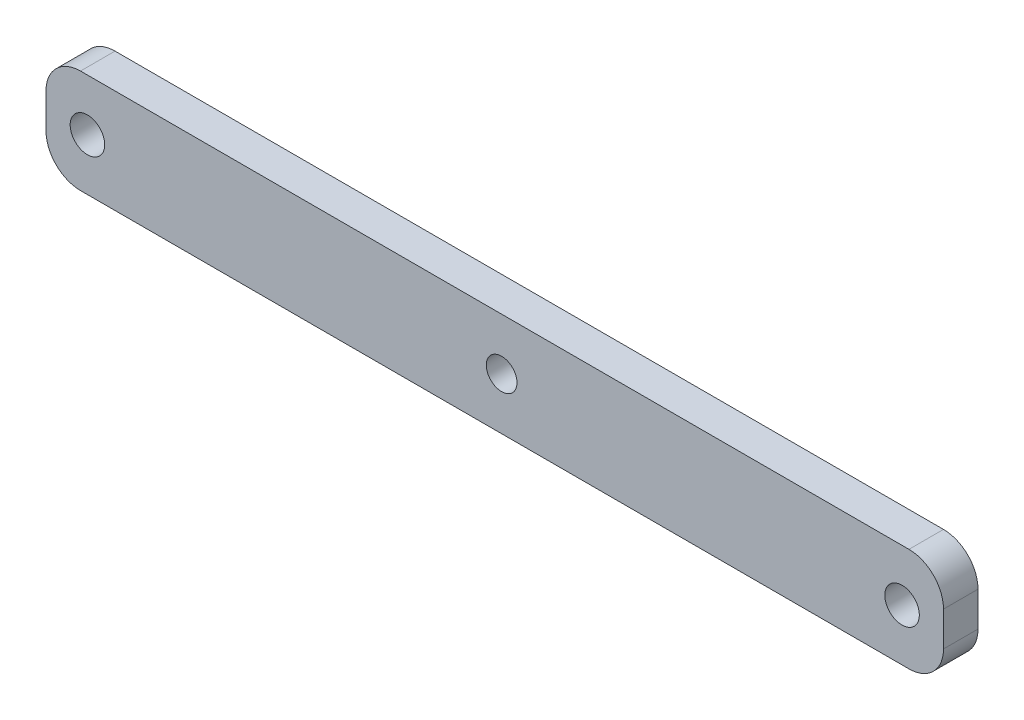
ISO-10303-21;
HEADER;
FILE_DESCRIPTION(('STEP AP214'),'2;1');
FILE_NAME('part.step','',(''),(''),'','','');
FILE_SCHEMA(('AUTOMOTIVE_DESIGN { 1 0 10303 214 1 1 1 1 }'));
ENDSEC;
DATA;
#1=APPLICATION_CONTEXT('core data for automotive mechanical design processes');
#2=APPLICATION_PROTOCOL_DEFINITION('international standard','automotive_design',2000,#1);
#3=PRODUCT_CONTEXT('',#1,'mechanical');
#4=PRODUCT('Part','Part','',(#3));
#5=PRODUCT_RELATED_PRODUCT_CATEGORY('part','',(#4));
#6=PRODUCT_DEFINITION_FORMATION('','',#4);
#7=PRODUCT_DEFINITION_CONTEXT('part definition',#1,'design');
#8=PRODUCT_DEFINITION('design','',#6,#7);
#9=PRODUCT_DEFINITION_SHAPE('','',#8);
#10=(LENGTH_UNIT() NAMED_UNIT(*) SI_UNIT(.MILLI.,.METRE.));
#11=(NAMED_UNIT(*) PLANE_ANGLE_UNIT() SI_UNIT($,.RADIAN.));
#12=(NAMED_UNIT(*) SI_UNIT($,.STERADIAN.) SOLID_ANGLE_UNIT());
#13=UNCERTAINTY_MEASURE_WITH_UNIT(LENGTH_MEASURE(1.E-05),#10,'distance_accuracy_value','');
#14=(GEOMETRIC_REPRESENTATION_CONTEXT(3) GLOBAL_UNCERTAINTY_ASSIGNED_CONTEXT((#13)) GLOBAL_UNIT_ASSIGNED_CONTEXT((#10,
#11,#12)) REPRESENTATION_CONTEXT('',''));
#15=CARTESIAN_POINT('',(0.,0.,0.));
#16=DIRECTION('',(0.,0.,1.));
#17=DIRECTION('',(1.,0.,0.));
#18=AXIS2_PLACEMENT_3D('',#15,#16,#17);
#19=CARTESIAN_POINT('',(-21.9862403540122,-6.9997524337533,5.));
#20=DIRECTION('',(0.,0.,-1.));
#21=DIRECTION('',(-1.,0.,0.));
#22=AXIS2_PLACEMENT_3D('',#19,#20,#21);
#23=PLANE('',#22);
#24=CARTESIAN_POINT('',(-21.9862403540122,-6.9997524337533,5.));
#25=DIRECTION('',(0.,0.,1.));
#26=DIRECTION('',(-1.,0.,0.));
#27=AXIS2_PLACEMENT_3D('',#24,#25,#26);
#28=CIRCLE('',#27,5.00000000000001);
#29=CARTESIAN_POINT('',(-21.9862403540122,-1.9997524337533,5.));
#30=VERTEX_POINT('',#29);
#31=CARTESIAN_POINT('',(-26.9862403540122,-6.9997524337533,5.));
#32=VERTEX_POINT('',#31);
#33=EDGE_CURVE('E147',#30,#32,#28,.T.);
#34=ORIENTED_EDGE('',*,*,#33,.T.);
#35=DIRECTION('',(0.,-1.,0.));
#36=VECTOR('',#35,1.);
#37=CARTESIAN_POINT('',(-26.9862403540122,-11.9997524337533,5.));
#38=LINE('',#37,#36);
#39=CARTESIAN_POINT('',(-26.9862403540122,-11.9997524337533,5.));
#40=VERTEX_POINT('',#39);
#41=EDGE_CURVE('E95',#32,#40,#38,.T.);
#42=ORIENTED_EDGE('',*,*,#41,.T.);
#43=CARTESIAN_POINT('',(-21.9862403540122,-11.9997524337533,5.));
#44=DIRECTION('',(0.,0.,1.));
#45=DIRECTION('',(-1.,0.,0.));
#46=AXIS2_PLACEMENT_3D('',#43,#44,#45);
#47=CIRCLE('',#46,5.00000000000001);
#48=CARTESIAN_POINT('',(-21.9862403540122,-16.9997524337533,5.));
#49=VERTEX_POINT('',#48);
#50=EDGE_CURVE('E162',#40,#49,#47,.T.);
#51=ORIENTED_EDGE('',*,*,#50,.T.);
#52=DIRECTION('',(1.,0.,0.));
#53=VECTOR('',#52,1.);
#54=CARTESIAN_POINT('',(98.0137596459878,-16.9997524337533,5.));
#55=LINE('',#54,#53);
#56=CARTESIAN_POINT('',(98.0137596459878,-16.9997524337533,5.));
#57=VERTEX_POINT('',#56);
#58=EDGE_CURVE('E175',#49,#57,#55,.T.);
#59=ORIENTED_EDGE('',*,*,#58,.T.);
#60=CARTESIAN_POINT('',(98.0137596459878,-11.9997524337533,5.));
#61=DIRECTION('',(0.,0.,1.));
#62=DIRECTION('',(-1.,0.,0.));
#63=AXIS2_PLACEMENT_3D('',#60,#61,#62);
#64=CIRCLE('',#63,5.00000000000001);
#65=CARTESIAN_POINT('',(103.013759645988,-11.9997524337533,5.));
#66=VERTEX_POINT('',#65);
#67=EDGE_CURVE('E114',#57,#66,#64,.T.);
#68=ORIENTED_EDGE('',*,*,#67,.T.);
#69=DIRECTION('',(0.,1.,0.));
#70=VECTOR('',#69,1.);
#71=CARTESIAN_POINT('',(103.013759645988,-6.99975243375331,5.));
#72=LINE('',#71,#70);
#73=CARTESIAN_POINT('',(103.013759645988,-6.99975243375331,5.));
#74=VERTEX_POINT('',#73);
#75=EDGE_CURVE('E108',#66,#74,#72,.T.);
#76=ORIENTED_EDGE('',*,*,#75,.T.);
#77=CARTESIAN_POINT('',(98.0137596459878,-6.9997524337533,5.));
#78=DIRECTION('',(0.,0.,1.));
#79=DIRECTION('',(-1.,0.,0.));
#80=AXIS2_PLACEMENT_3D('',#77,#78,#79);
#81=CIRCLE('',#80,5.);
#82=CARTESIAN_POINT('',(98.0137596459878,-1.99975243375329,5.));
#83=VERTEX_POINT('',#82);
#84=EDGE_CURVE('E112',#74,#83,#81,.T.);
#85=ORIENTED_EDGE('',*,*,#84,.T.);
#86=DIRECTION('',(-1.,0.,0.));
#87=VECTOR('',#86,1.);
#88=CARTESIAN_POINT('',(-21.9862403540122,-1.9997524337533,5.));
#89=LINE('',#88,#87);
#90=EDGE_CURVE('E52',#83,#30,#89,.T.);
#91=ORIENTED_EDGE('',*,*,#90,.T.);
#92=EDGE_LOOP('',(#34,#42,#51,#59,#68,#76,#85,#91));
#93=FACE_BOUND('',#92,.T.);
#94=CARTESIAN_POINT('',(-20.9862403540122,-9.4997524337533,5.));
#95=DIRECTION('',(0.,0.,1.));
#96=DIRECTION('',(1.,0.,0.));
#97=AXIS2_PLACEMENT_3D('',#94,#95,#96);
#98=CIRCLE('',#97,2.5);
#99=CARTESIAN_POINT('',(-18.4862403540122,-9.4997524337533,5.));
#100=VERTEX_POINT('',#99);
#101=EDGE_CURVE('E136',#100,#100,#98,.T.);
#102=ORIENTED_EDGE('',*,*,#101,.F.);
#103=EDGE_LOOP('',(#102));
#104=FACE_BOUND('',#103,.T.);
#105=CARTESIAN_POINT('',(97.0137596459878,-9.49975243375326,5.));
#106=DIRECTION('',(0.,0.,1.));
#107=DIRECTION('',(-1.,0.,0.));
#108=AXIS2_PLACEMENT_3D('',#105,#106,#107);
#109=CIRCLE('',#108,2.5);
#110=CARTESIAN_POINT('',(94.5137596459878,-9.49975243375326,5.));
#111=VERTEX_POINT('',#110);
#112=EDGE_CURVE('E184',#111,#111,#109,.T.);
#113=ORIENTED_EDGE('',*,*,#112,.F.);
#114=EDGE_LOOP('',(#113));
#115=FACE_BOUND('',#114,.T.);
#116=CARTESIAN_POINT('',(39.0137596459878,-9.4997524337533,5.));
#117=DIRECTION('',(0.,0.,1.));
#118=DIRECTION('',(1.,0.,0.));
#119=AXIS2_PLACEMENT_3D('',#116,#117,#118);
#120=CIRCLE('',#119,2.2234157242308);
#121=CARTESIAN_POINT('',(41.2371753702186,-9.4997524337533,5.));
#122=VERTEX_POINT('',#121);
#123=EDGE_CURVE('E190',#122,#122,#120,.T.);
#124=ORIENTED_EDGE('',*,*,#123,.F.);
#125=EDGE_LOOP('',(#124));
#126=FACE_BOUND('',#125,.T.);
#127=ADVANCED_FACE('F35',(#93,#104,#115,#126),#23,.F.);
#128=CARTESIAN_POINT('',(-21.9862403540122,-6.9997524337533,0.));
#129=DIRECTION('',(0.,0.,-1.));
#130=DIRECTION('',(-1.,0.,0.));
#131=AXIS2_PLACEMENT_3D('',#128,#129,#130);
#132=PLANE('',#131);
#133=CARTESIAN_POINT('',(97.0137596459878,-9.49975243375326,0.));
#134=DIRECTION('',(0.,0.,1.));
#135=DIRECTION('',(-1.,0.,0.));
#136=AXIS2_PLACEMENT_3D('',#133,#134,#135);
#137=CIRCLE('',#136,2.5);
#138=CARTESIAN_POINT('',(94.5137596459878,-9.49975243375326,0.));
#139=VERTEX_POINT('',#138);
#140=EDGE_CURVE('E187',#139,#139,#137,.T.);
#141=ORIENTED_EDGE('',*,*,#140,.T.);
#142=EDGE_LOOP('',(#141));
#143=FACE_BOUND('',#142,.T.);
#144=CARTESIAN_POINT('',(-21.9862403540122,-6.9997524337533,0.));
#145=DIRECTION('',(0.,0.,1.));
#146=DIRECTION('',(-1.,0.,0.));
#147=AXIS2_PLACEMENT_3D('',#144,#145,#146);
#148=CIRCLE('',#147,5.00000000000001);
#149=CARTESIAN_POINT('',(-21.9862403540122,-1.9997524337533,0.));
#150=VERTEX_POINT('',#149);
#151=CARTESIAN_POINT('',(-26.9862403540122,-6.9997524337533,0.));
#152=VERTEX_POINT('',#151);
#153=EDGE_CURVE('E132',#150,#152,#148,.T.);
#154=ORIENTED_EDGE('',*,*,#153,.F.);
#155=DIRECTION('',(-1.,0.,0.));
#156=VECTOR('',#155,1.);
#157=CARTESIAN_POINT('',(-21.9862403540122,-1.9997524337533,0.));
#158=LINE('',#157,#156);
#159=CARTESIAN_POINT('',(98.0137596459878,-1.99975243375329,0.));
#160=VERTEX_POINT('',#159);
#161=EDGE_CURVE('E87',#160,#150,#158,.T.);
#162=ORIENTED_EDGE('',*,*,#161,.F.);
#163=CARTESIAN_POINT('',(98.0137596459878,-6.9997524337533,0.));
#164=DIRECTION('',(0.,0.,1.));
#165=DIRECTION('',(-1.,0.,0.));
#166=AXIS2_PLACEMENT_3D('',#163,#164,#165);
#167=CIRCLE('',#166,5.);
#168=CARTESIAN_POINT('',(103.013759645988,-6.99975243375331,0.));
#169=VERTEX_POINT('',#168);
#170=EDGE_CURVE('E81',#169,#160,#167,.T.);
#171=ORIENTED_EDGE('',*,*,#170,.F.);
#172=DIRECTION('',(0.,1.,0.));
#173=VECTOR('',#172,1.);
#174=CARTESIAN_POINT('',(103.013759645988,-6.99975243375331,0.));
#175=LINE('',#174,#173);
#176=CARTESIAN_POINT('',(103.013759645988,-11.9997524337533,0.));
#177=VERTEX_POINT('',#176);
#178=EDGE_CURVE('E122',#177,#169,#175,.T.);
#179=ORIENTED_EDGE('',*,*,#178,.F.);
#180=CARTESIAN_POINT('',(98.0137596459878,-11.9997524337533,0.));
#181=DIRECTION('',(0.,0.,1.));
#182=DIRECTION('',(-1.,0.,0.));
#183=AXIS2_PLACEMENT_3D('',#180,#181,#182);
#184=CIRCLE('',#183,5.00000000000001);
#185=CARTESIAN_POINT('',(98.0137596459878,-16.9997524337533,0.));
#186=VERTEX_POINT('',#185);
#187=EDGE_CURVE('E142',#186,#177,#184,.T.);
#188=ORIENTED_EDGE('',*,*,#187,.F.);
#189=DIRECTION('',(1.,0.,0.));
#190=VECTOR('',#189,1.);
#191=CARTESIAN_POINT('',(98.0137596459878,-16.9997524337533,0.));
#192=LINE('',#191,#190);
#193=CARTESIAN_POINT('',(-21.9862403540122,-16.9997524337533,0.));
#194=VERTEX_POINT('',#193);
#195=EDGE_CURVE('E140',#194,#186,#192,.T.);
#196=ORIENTED_EDGE('',*,*,#195,.F.);
#197=CARTESIAN_POINT('',(-21.9862403540122,-11.9997524337533,0.));
#198=DIRECTION('',(0.,0.,1.));
#199=DIRECTION('',(-1.,0.,0.));
#200=AXIS2_PLACEMENT_3D('',#197,#198,#199);
#201=CIRCLE('',#200,5.00000000000001);
#202=CARTESIAN_POINT('',(-26.9862403540122,-11.9997524337533,0.));
#203=VERTEX_POINT('',#202);
#204=EDGE_CURVE('E138',#203,#194,#201,.T.);
#205=ORIENTED_EDGE('',*,*,#204,.F.);
#206=DIRECTION('',(0.,-1.,0.));
#207=VECTOR('',#206,1.);
#208=CARTESIAN_POINT('',(-26.9862403540122,-11.9997524337533,0.));
#209=LINE('',#208,#207);
#210=EDGE_CURVE('E135',#152,#203,#209,.T.);
#211=ORIENTED_EDGE('',*,*,#210,.F.);
#212=EDGE_LOOP('',(#154,#162,#171,#179,#188,#196,#205,#211));
#213=FACE_BOUND('',#212,.T.);
#214=CARTESIAN_POINT('',(-20.9862403540122,-9.4997524337533,0.));
#215=DIRECTION('',(0.,0.,1.));
#216=DIRECTION('',(1.,0.,0.));
#217=AXIS2_PLACEMENT_3D('',#214,#215,#216);
#218=CIRCLE('',#217,2.5);
#219=CARTESIAN_POINT('',(-18.4862403540122,-9.4997524337533,0.));
#220=VERTEX_POINT('',#219);
#221=EDGE_CURVE('E181',#220,#220,#218,.T.);
#222=ORIENTED_EDGE('',*,*,#221,.T.);
#223=EDGE_LOOP('',(#222));
#224=FACE_BOUND('',#223,.T.);
#225=CARTESIAN_POINT('',(39.0137596459878,-9.4997524337533,0.));
#226=DIRECTION('',(0.,0.,1.));
#227=DIRECTION('',(1.,0.,0.));
#228=AXIS2_PLACEMENT_3D('',#225,#226,#227);
#229=CIRCLE('',#228,2.2234157242308);
#230=CARTESIAN_POINT('',(41.2371753702186,-9.4997524337533,0.));
#231=VERTEX_POINT('',#230);
#232=EDGE_CURVE('E193',#231,#231,#229,.T.);
#233=ORIENTED_EDGE('',*,*,#232,.T.);
#234=EDGE_LOOP('',(#233));
#235=FACE_BOUND('',#234,.T.);
#236=ADVANCED_FACE('F166',(#143,#213,#224,#235),#132,.T.);
#237=CARTESIAN_POINT('',(-21.9862403540122,-6.9997524337533,5.));
#238=DIRECTION('',(0.,0.,-1.));
#239=DIRECTION('',(-1.,0.,0.));
#240=AXIS2_PLACEMENT_3D('',#237,#238,#239);
#241=CYLINDRICAL_SURFACE('',#240,5.00000000000001);
#242=ORIENTED_EDGE('',*,*,#153,.T.);
#243=DIRECTION('',(0.,0.,-1.));
#244=VECTOR('',#243,1.);
#245=CARTESIAN_POINT('',(-26.9862403540122,-6.9997524337533,5.));
#246=LINE('',#245,#244);
#247=EDGE_CURVE('E11',#32,#152,#246,.T.);
#248=ORIENTED_EDGE('',*,*,#247,.F.);
#249=ORIENTED_EDGE('',*,*,#33,.F.);
#250=DIRECTION('',(0.,0.,-1.));
#251=VECTOR('',#250,1.);
#252=CARTESIAN_POINT('',(-21.9862403540122,-1.9997524337533,5.));
#253=LINE('',#252,#251);
#254=EDGE_CURVE('E128',#30,#150,#253,.T.);
#255=ORIENTED_EDGE('',*,*,#254,.T.);
#256=EDGE_LOOP('',(#242,#248,#249,#255));
#257=FACE_BOUND('',#256,.T.);
#258=ADVANCED_FACE('F37',(#257),#241,.T.);
#259=CARTESIAN_POINT('',(-26.9862403540122,-11.9997524337533,5.));
#260=DIRECTION('',(1.,0.,0.));
#261=DIRECTION('',(0.,0.,-1.));
#262=AXIS2_PLACEMENT_3D('',#259,#260,#261);
#263=PLANE('',#262);
#264=ORIENTED_EDGE('',*,*,#210,.T.);
#265=DIRECTION('',(0.,0.,-1.));
#266=VECTOR('',#265,1.);
#267=CARTESIAN_POINT('',(-26.9862403540122,-11.9997524337533,5.));
#268=LINE('',#267,#266);
#269=EDGE_CURVE('E44',#40,#203,#268,.T.);
#270=ORIENTED_EDGE('',*,*,#269,.F.);
#271=ORIENTED_EDGE('',*,*,#41,.F.);
#272=ORIENTED_EDGE('',*,*,#247,.T.);
#273=EDGE_LOOP('',(#264,#270,#271,#272));
#274=FACE_BOUND('',#273,.T.);
#275=ADVANCED_FACE('F225',(#274),#263,.F.);
#276=CARTESIAN_POINT('',(-21.9862403540122,-11.9997524337533,5.));
#277=DIRECTION('',(0.,0.,-1.));
#278=DIRECTION('',(-1.,0.,0.));
#279=AXIS2_PLACEMENT_3D('',#276,#277,#278);
#280=CYLINDRICAL_SURFACE('',#279,5.00000000000001);
#281=ORIENTED_EDGE('',*,*,#204,.T.);
#282=DIRECTION('',(0.,0.,-1.));
#283=VECTOR('',#282,1.);
#284=CARTESIAN_POINT('',(-21.9862403540122,-16.9997524337533,5.));
#285=LINE('',#284,#283);
#286=EDGE_CURVE('E154',#49,#194,#285,.T.);
#287=ORIENTED_EDGE('',*,*,#286,.F.);
#288=ORIENTED_EDGE('',*,*,#50,.F.);
#289=ORIENTED_EDGE('',*,*,#269,.T.);
#290=EDGE_LOOP('',(#281,#287,#288,#289));
#291=FACE_BOUND('',#290,.T.);
#292=ADVANCED_FACE('F160',(#291),#280,.T.);
#293=CARTESIAN_POINT('',(98.0137596459878,-16.9997524337533,5.));
#294=DIRECTION('',(0.,1.,0.));
#295=DIRECTION('',(-1.,0.,0.));
#296=AXIS2_PLACEMENT_3D('',#293,#294,#295);
#297=PLANE('',#296);
#298=ORIENTED_EDGE('',*,*,#195,.T.);
#299=DIRECTION('',(0.,0.,-1.));
#300=VECTOR('',#299,1.);
#301=CARTESIAN_POINT('',(98.0137596459878,-16.9997524337533,5.));
#302=LINE('',#301,#300);
#303=EDGE_CURVE('E151',#57,#186,#302,.T.);
#304=ORIENTED_EDGE('',*,*,#303,.F.);
#305=ORIENTED_EDGE('',*,*,#58,.F.);
#306=ORIENTED_EDGE('',*,*,#286,.T.);
#307=EDGE_LOOP('',(#298,#304,#305,#306));
#308=FACE_BOUND('',#307,.T.);
#309=ADVANCED_FACE('F171',(#308),#297,.F.);
#310=CARTESIAN_POINT('',(98.0137596459878,-11.9997524337533,5.));
#311=DIRECTION('',(0.,0.,-1.));
#312=DIRECTION('',(-1.,0.,0.));
#313=AXIS2_PLACEMENT_3D('',#310,#311,#312);
#314=CYLINDRICAL_SURFACE('',#313,5.00000000000001);
#315=ORIENTED_EDGE('',*,*,#187,.T.);
#316=DIRECTION('',(0.,0.,-1.));
#317=VECTOR('',#316,1.);
#318=CARTESIAN_POINT('',(103.013759645988,-11.9997524337533,5.));
#319=LINE('',#318,#317);
#320=EDGE_CURVE('E123',#66,#177,#319,.T.);
#321=ORIENTED_EDGE('',*,*,#320,.F.);
#322=ORIENTED_EDGE('',*,*,#67,.F.);
#323=ORIENTED_EDGE('',*,*,#303,.T.);
#324=EDGE_LOOP('',(#315,#321,#322,#323));
#325=FACE_BOUND('',#324,.T.);
#326=ADVANCED_FACE('F174',(#325),#314,.T.);
#327=CARTESIAN_POINT('',(103.013759645988,-6.99975243375331,5.));
#328=DIRECTION('',(-1.,0.,0.));
#329=DIRECTION('',(0.,0.,1.));
#330=AXIS2_PLACEMENT_3D('',#327,#328,#329);
#331=PLANE('',#330);
#332=ORIENTED_EDGE('',*,*,#178,.T.);
#333=DIRECTION('',(0.,0.,-1.));
#334=VECTOR('',#333,1.);
#335=CARTESIAN_POINT('',(103.013759645988,-6.99975243375331,5.));
#336=LINE('',#335,#334);
#337=EDGE_CURVE('E119',#74,#169,#336,.T.);
#338=ORIENTED_EDGE('',*,*,#337,.F.);
#339=ORIENTED_EDGE('',*,*,#75,.F.);
#340=ORIENTED_EDGE('',*,*,#320,.T.);
#341=EDGE_LOOP('',(#332,#338,#339,#340));
#342=FACE_BOUND('',#341,.T.);
#343=ADVANCED_FACE('F120',(#342),#331,.F.);
#344=CARTESIAN_POINT('',(98.0137596459878,-6.9997524337533,5.));
#345=DIRECTION('',(0.,0.,-1.));
#346=DIRECTION('',(-1.,0.,0.));
#347=AXIS2_PLACEMENT_3D('',#344,#345,#346);
#348=CYLINDRICAL_SURFACE('',#347,5.);
#349=ORIENTED_EDGE('',*,*,#170,.T.);
#350=DIRECTION('',(0.,0.,-1.));
#351=VECTOR('',#350,1.);
#352=CARTESIAN_POINT('',(98.0137596459878,-1.99975243375329,5.));
#353=LINE('',#352,#351);
#354=EDGE_CURVE('E124',#83,#160,#353,.T.);
#355=ORIENTED_EDGE('',*,*,#354,.F.);
#356=ORIENTED_EDGE('',*,*,#84,.F.);
#357=ORIENTED_EDGE('',*,*,#337,.T.);
#358=EDGE_LOOP('',(#349,#355,#356,#357));
#359=FACE_BOUND('',#358,.T.);
#360=ADVANCED_FACE('F126',(#359),#348,.T.);
#361=CARTESIAN_POINT('',(-21.9862403540122,-1.9997524337533,5.));
#362=DIRECTION('',(0.,-1.,0.));
#363=DIRECTION('',(1.,0.,0.));
#364=AXIS2_PLACEMENT_3D('',#361,#362,#363);
#365=PLANE('',#364);
#366=ORIENTED_EDGE('',*,*,#161,.T.);
#367=ORIENTED_EDGE('',*,*,#254,.F.);
#368=ORIENTED_EDGE('',*,*,#90,.F.);
#369=ORIENTED_EDGE('',*,*,#354,.T.);
#370=EDGE_LOOP('',(#366,#367,#368,#369));
#371=FACE_BOUND('',#370,.T.);
#372=ADVANCED_FACE('F213',(#371),#365,.F.);
#373=CARTESIAN_POINT('',(-20.9862403540122,-9.4997524337533,5.));
#374=DIRECTION('',(0.,0.,-1.));
#375=DIRECTION('',(-1.,0.,0.));
#376=AXIS2_PLACEMENT_3D('',#373,#374,#375);
#377=CYLINDRICAL_SURFACE('',#376,2.5);
#378=ORIENTED_EDGE('',*,*,#101,.T.);
#379=EDGE_LOOP('',(#378));
#380=FACE_BOUND('',#379,.T.);
#381=ORIENTED_EDGE('',*,*,#221,.F.);
#382=EDGE_LOOP('',(#381));
#383=FACE_BOUND('',#382,.T.);
#384=ADVANCED_FACE('F210',(#380,#383),#377,.F.);
#385=CARTESIAN_POINT('',(97.0137596459878,-9.49975243375326,5.));
#386=DIRECTION('',(0.,0.,-1.));
#387=DIRECTION('',(-1.,0.,0.));
#388=AXIS2_PLACEMENT_3D('',#385,#386,#387);
#389=CYLINDRICAL_SURFACE('',#388,2.5);
#390=ORIENTED_EDGE('',*,*,#112,.T.);
#391=EDGE_LOOP('',(#390));
#392=FACE_BOUND('',#391,.T.);
#393=ORIENTED_EDGE('',*,*,#140,.F.);
#394=EDGE_LOOP('',(#393));
#395=FACE_BOUND('',#394,.T.);
#396=ADVANCED_FACE('F289',(#392,#395),#389,.F.);
#397=CARTESIAN_POINT('',(39.0137596459878,-9.4997524337533,5.));
#398=DIRECTION('',(0.,0.,-1.));
#399=DIRECTION('',(-1.,0.,0.));
#400=AXIS2_PLACEMENT_3D('',#397,#398,#399);
#401=CYLINDRICAL_SURFACE('',#400,2.2234157242308);
#402=ORIENTED_EDGE('',*,*,#123,.T.);
#403=EDGE_LOOP('',(#402));
#404=FACE_BOUND('',#403,.T.);
#405=ORIENTED_EDGE('',*,*,#232,.F.);
#406=EDGE_LOOP('',(#405));
#407=FACE_BOUND('',#406,.T.);
#408=ADVANCED_FACE('F199',(#404,#407),#401,.F.);
#409=CLOSED_SHELL('',(#127,#236,#258,#275,#292,#309,#326,#343,#360,#372,#384,#396,#408));
#410=MANIFOLD_SOLID_BREP('B2',#409);
#411=ADVANCED_BREP_SHAPE_REPRESENTATION('',(#18,#410),#14);
#412=SHAPE_DEFINITION_REPRESENTATION(#9,#411);
ENDSEC;
END-ISO-10303-21;
